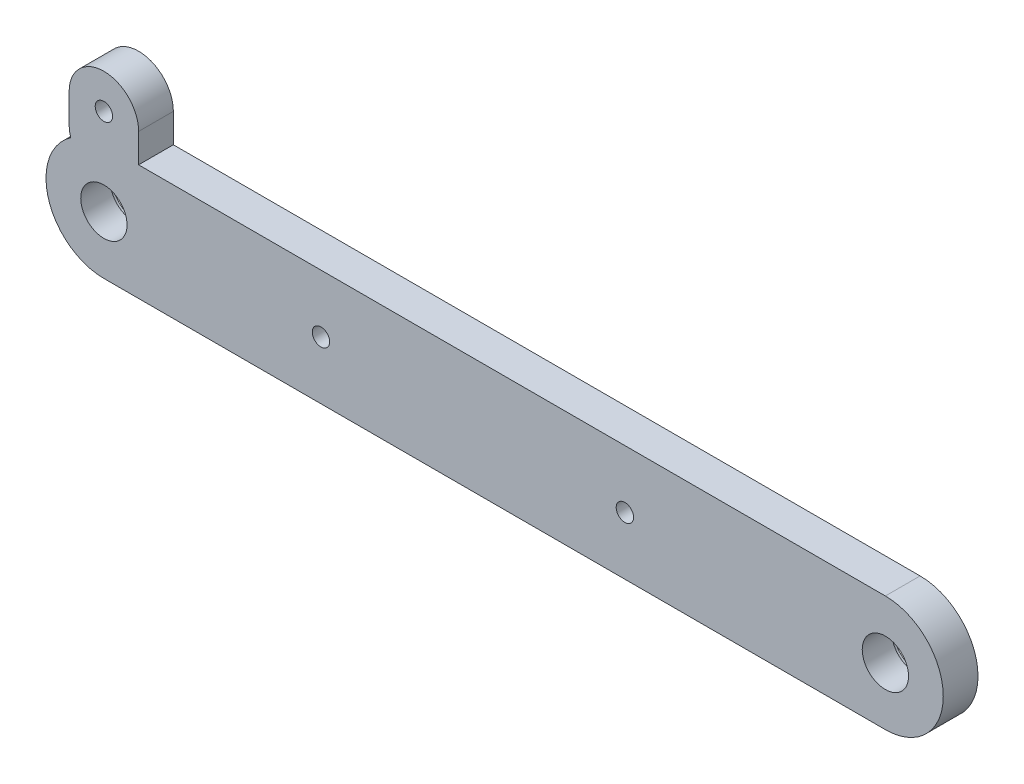
ISO-10303-21;
HEADER;
FILE_DESCRIPTION(('STEP AP214'),'2;1');
FILE_NAME('part.step','',(''),(''),'','','');
FILE_SCHEMA(('AUTOMOTIVE_DESIGN { 1 0 10303 214 1 1 1 1 }'));
ENDSEC;
DATA;
#1=APPLICATION_CONTEXT('core data for automotive mechanical design processes');
#2=APPLICATION_PROTOCOL_DEFINITION('international standard','automotive_design',2000,#1);
#3=PRODUCT_CONTEXT('',#1,'mechanical');
#4=PRODUCT('Part','Part','',(#3));
#5=PRODUCT_RELATED_PRODUCT_CATEGORY('part','',(#4));
#6=PRODUCT_DEFINITION_FORMATION('','',#4);
#7=PRODUCT_DEFINITION_CONTEXT('part definition',#1,'design');
#8=PRODUCT_DEFINITION('design','',#6,#7);
#9=PRODUCT_DEFINITION_SHAPE('','',#8);
#10=(LENGTH_UNIT() NAMED_UNIT(*) SI_UNIT(.MILLI.,.METRE.));
#11=(NAMED_UNIT(*) PLANE_ANGLE_UNIT() SI_UNIT($,.RADIAN.));
#12=(NAMED_UNIT(*) SI_UNIT($,.STERADIAN.) SOLID_ANGLE_UNIT());
#13=UNCERTAINTY_MEASURE_WITH_UNIT(LENGTH_MEASURE(1.E-05),#10,'distance_accuracy_value','');
#14=(GEOMETRIC_REPRESENTATION_CONTEXT(3) GLOBAL_UNCERTAINTY_ASSIGNED_CONTEXT((#13)) GLOBAL_UNIT_ASSIGNED_CONTEXT((#10,
#11,#12)) REPRESENTATION_CONTEXT('',''));
#15=CARTESIAN_POINT('',(0.,0.,0.));
#16=DIRECTION('',(0.,0.,1.));
#17=DIRECTION('',(1.,0.,0.));
#18=AXIS2_PLACEMENT_3D('',#15,#16,#17);
#19=CARTESIAN_POINT('',(0.,0.,6.));
#20=DIRECTION('',(0.,0.,-1.));
#21=DIRECTION('',(-1.,0.,0.));
#22=AXIS2_PLACEMENT_3D('',#19,#20,#21);
#23=CYLINDRICAL_SURFACE('',#22,4.);
#24=CARTESIAN_POINT('',(0.,0.,6.));
#25=DIRECTION('',(0.,0.,1.));
#26=DIRECTION('',(1.,0.,0.));
#27=AXIS2_PLACEMENT_3D('',#24,#25,#26);
#28=CIRCLE('',#27,4.);
#29=CARTESIAN_POINT('',(4.,0.,6.));
#30=VERTEX_POINT('',#29);
#31=EDGE_CURVE('E140',#30,#30,#28,.T.);
#32=ORIENTED_EDGE('',*,*,#31,.T.);
#33=EDGE_LOOP('',(#32));
#34=FACE_BOUND('',#33,.T.);
#35=CARTESIAN_POINT('',(0.,0.,0.9));
#36=DIRECTION('',(0.,0.,-1.));
#37=DIRECTION('',(-1.,0.,0.));
#38=AXIS2_PLACEMENT_3D('',#35,#36,#37);
#39=CIRCLE('',#38,4.);
#40=CARTESIAN_POINT('',(-4.,0.,0.9));
#41=VERTEX_POINT('',#40);
#42=EDGE_CURVE('E152',#41,#41,#39,.T.);
#43=ORIENTED_EDGE('',*,*,#42,.T.);
#44=EDGE_LOOP('',(#43));
#45=FACE_BOUND('',#44,.T.);
#46=ADVANCED_FACE('F43',(#34,#45),#23,.F.);
#47=CARTESIAN_POINT('',(0.,9.99999999999999,6.));
#48=DIRECTION('',(0.,0.,-1.));
#49=DIRECTION('',(-1.,0.,0.));
#50=AXIS2_PLACEMENT_3D('',#47,#48,#49);
#51=CYLINDRICAL_SURFACE('',#50,6.);
#52=CARTESIAN_POINT('',(0.,9.99999999999999,0.));
#53=DIRECTION('',(0.,0.,1.));
#54=DIRECTION('',(1.,0.,0.));
#55=AXIS2_PLACEMENT_3D('',#52,#53,#54);
#56=CIRCLE('',#55,6.);
#57=CARTESIAN_POINT('',(-6.,10.,0.));
#58=VERTEX_POINT('',#57);
#59=CARTESIAN_POINT('',(-5.72363520850168,8.2,0.));
#60=VERTEX_POINT('',#59);
#61=EDGE_CURVE('E149',#58,#60,#56,.T.);
#62=ORIENTED_EDGE('',*,*,#61,.T.);
#63=DIRECTION('',(0.,0.,-1.));
#64=VECTOR('',#63,1.);
#65=CARTESIAN_POINT('',(-5.72363520850168,8.2,6.));
#66=LINE('',#65,#64);
#67=CARTESIAN_POINT('',(-5.72363520850168,8.2,6.));
#68=VERTEX_POINT('',#67);
#69=EDGE_CURVE('E11',#68,#60,#66,.T.);
#70=ORIENTED_EDGE('',*,*,#69,.F.);
#71=CARTESIAN_POINT('',(0.,9.99999999999999,6.));
#72=DIRECTION('',(0.,0.,1.));
#73=DIRECTION('',(1.,0.,0.));
#74=AXIS2_PLACEMENT_3D('',#71,#72,#73);
#75=CIRCLE('',#74,6.);
#76=CARTESIAN_POINT('',(-6.,10.,6.));
#77=VERTEX_POINT('',#76);
#78=EDGE_CURVE('E168',#77,#68,#75,.T.);
#79=ORIENTED_EDGE('',*,*,#78,.F.);
#80=DIRECTION('',(0.,0.,-1.));
#81=VECTOR('',#80,1.);
#82=CARTESIAN_POINT('',(-6.,10.,6.));
#83=LINE('',#82,#81);
#84=EDGE_CURVE('E62',#77,#58,#83,.T.);
#85=ORIENTED_EDGE('',*,*,#84,.T.);
#86=EDGE_LOOP('',(#62,#70,#79,#85));
#87=FACE_BOUND('',#86,.T.);
#88=ADVANCED_FACE('F45',(#87),#51,.T.);
#89=CARTESIAN_POINT('',(0.,0.,6.));
#90=DIRECTION('',(0.,0.,-1.));
#91=DIRECTION('',(-1.,0.,0.));
#92=AXIS2_PLACEMENT_3D('',#89,#90,#91);
#93=CYLINDRICAL_SURFACE('',#92,10.);
#94=CARTESIAN_POINT('',(0.,0.,0.));
#95=DIRECTION('',(0.,0.,1.));
#96=DIRECTION('',(1.,0.,0.));
#97=AXIS2_PLACEMENT_3D('',#94,#95,#96);
#98=CIRCLE('',#97,10.);
#99=CARTESIAN_POINT('',(0.,-10.,0.));
#100=VERTEX_POINT('',#99);
#101=EDGE_CURVE('E151',#60,#100,#98,.T.);
#102=ORIENTED_EDGE('',*,*,#101,.T.);
#103=DIRECTION('',(0.,0.,-1.));
#104=VECTOR('',#103,1.);
#105=CARTESIAN_POINT('',(0.,-10.,6.));
#106=LINE('',#105,#104);
#107=CARTESIAN_POINT('',(0.,-10.,6.));
#108=VERTEX_POINT('',#107);
#109=EDGE_CURVE('E53',#108,#100,#106,.T.);
#110=ORIENTED_EDGE('',*,*,#109,.F.);
#111=CARTESIAN_POINT('',(0.,0.,6.));
#112=DIRECTION('',(0.,0.,1.));
#113=DIRECTION('',(1.,0.,0.));
#114=AXIS2_PLACEMENT_3D('',#111,#112,#113);
#115=CIRCLE('',#114,10.);
#116=EDGE_CURVE('E101',#68,#108,#115,.T.);
#117=ORIENTED_EDGE('',*,*,#116,.F.);
#118=ORIENTED_EDGE('',*,*,#69,.T.);
#119=EDGE_LOOP('',(#102,#110,#117,#118));
#120=FACE_BOUND('',#119,.T.);
#121=ADVANCED_FACE('F240',(#120),#93,.T.);
#122=CARTESIAN_POINT('',(0.,-10.,6.));
#123=DIRECTION('',(0.,1.,0.));
#124=DIRECTION('',(0.,0.,1.));
#125=AXIS2_PLACEMENT_3D('',#122,#123,#124);
#126=PLANE('',#125);
#127=DIRECTION('',(1.,0.,0.));
#128=VECTOR('',#127,1.);
#129=CARTESIAN_POINT('',(0.,-10.,0.));
#130=LINE('',#129,#128);
#131=CARTESIAN_POINT('',(135.,-10.,0.));
#132=VERTEX_POINT('',#131);
#133=EDGE_CURVE('E154',#100,#132,#130,.T.);
#134=ORIENTED_EDGE('',*,*,#133,.T.);
#135=DIRECTION('',(0.,0.,-1.));
#136=VECTOR('',#135,1.);
#137=CARTESIAN_POINT('',(135.,-10.,6.));
#138=LINE('',#137,#136);
#139=CARTESIAN_POINT('',(135.,-10.,6.));
#140=VERTEX_POINT('',#139);
#141=EDGE_CURVE('E174',#140,#132,#138,.T.);
#142=ORIENTED_EDGE('',*,*,#141,.F.);
#143=DIRECTION('',(1.,0.,0.));
#144=VECTOR('',#143,1.);
#145=CARTESIAN_POINT('',(0.,-10.,6.));
#146=LINE('',#145,#144);
#147=EDGE_CURVE('E213',#108,#140,#146,.T.);
#148=ORIENTED_EDGE('',*,*,#147,.F.);
#149=ORIENTED_EDGE('',*,*,#109,.T.);
#150=EDGE_LOOP('',(#134,#142,#148,#149));
#151=FACE_BOUND('',#150,.T.);
#152=ADVANCED_FACE('F430',(#151),#126,.F.);
#153=CARTESIAN_POINT('',(135.,0.,6.));
#154=DIRECTION('',(0.,0.,-1.));
#155=DIRECTION('',(-1.,0.,0.));
#156=AXIS2_PLACEMENT_3D('',#153,#154,#155);
#157=CYLINDRICAL_SURFACE('',#156,10.);
#158=CARTESIAN_POINT('',(135.,0.,0.));
#159=DIRECTION('',(0.,0.,1.));
#160=DIRECTION('',(1.,0.,0.));
#161=AXIS2_PLACEMENT_3D('',#158,#159,#160);
#162=CIRCLE('',#161,10.);
#163=CARTESIAN_POINT('',(135.,10.,0.));
#164=VERTEX_POINT('',#163);
#165=EDGE_CURVE('E156',#132,#164,#162,.T.);
#166=ORIENTED_EDGE('',*,*,#165,.T.);
#167=DIRECTION('',(0.,0.,-1.));
#168=VECTOR('',#167,1.);
#169=CARTESIAN_POINT('',(135.,10.,6.));
#170=LINE('',#169,#168);
#171=CARTESIAN_POINT('',(135.,10.,6.));
#172=VERTEX_POINT('',#171);
#173=EDGE_CURVE('E172',#172,#164,#170,.T.);
#174=ORIENTED_EDGE('',*,*,#173,.F.);
#175=CARTESIAN_POINT('',(135.,0.,6.));
#176=DIRECTION('',(0.,0.,1.));
#177=DIRECTION('',(1.,0.,0.));
#178=AXIS2_PLACEMENT_3D('',#175,#176,#177);
#179=CIRCLE('',#178,10.);
#180=EDGE_CURVE('E215',#140,#172,#179,.T.);
#181=ORIENTED_EDGE('',*,*,#180,.F.);
#182=ORIENTED_EDGE('',*,*,#141,.T.);
#183=EDGE_LOOP('',(#166,#174,#181,#182));
#184=FACE_BOUND('',#183,.T.);
#185=ADVANCED_FACE('F419',(#184),#157,.T.);
#186=CARTESIAN_POINT('',(0.,10.,6.));
#187=DIRECTION('',(0.,1.,0.));
#188=DIRECTION('',(0.,0.,1.));
#189=AXIS2_PLACEMENT_3D('',#186,#187,#188);
#190=PLANE('',#189);
#191=DIRECTION('',(1.,0.,0.));
#192=VECTOR('',#191,1.);
#193=CARTESIAN_POINT('',(0.,10.,0.));
#194=LINE('',#193,#192);
#195=CARTESIAN_POINT('',(6.,10.,0.));
#196=VERTEX_POINT('',#195);
#197=EDGE_CURVE('E159',#196,#164,#194,.T.);
#198=ORIENTED_EDGE('',*,*,#197,.F.);
#199=DIRECTION('',(0.,0.,-1.));
#200=VECTOR('',#199,1.);
#201=CARTESIAN_POINT('',(6.,10.,6.));
#202=LINE('',#201,#200);
#203=CARTESIAN_POINT('',(6.,10.,6.));
#204=VERTEX_POINT('',#203);
#205=EDGE_CURVE('E135',#204,#196,#202,.T.);
#206=ORIENTED_EDGE('',*,*,#205,.F.);
#207=DIRECTION('',(1.,0.,0.));
#208=VECTOR('',#207,1.);
#209=CARTESIAN_POINT('',(0.,10.,6.));
#210=LINE('',#209,#208);
#211=EDGE_CURVE('E125',#204,#172,#210,.T.);
#212=ORIENTED_EDGE('',*,*,#211,.T.);
#213=ORIENTED_EDGE('',*,*,#173,.T.);
#214=EDGE_LOOP('',(#198,#206,#212,#213));
#215=FACE_BOUND('',#214,.T.);
#216=ADVANCED_FACE('F218',(#215),#190,.T.);
#217=CARTESIAN_POINT('',(6.,0.,6.));
#218=DIRECTION('',(-1.,0.,0.));
#219=DIRECTION('',(0.,-1.,0.));
#220=AXIS2_PLACEMENT_3D('',#217,#218,#219);
#221=PLANE('',#220);
#222=DIRECTION('',(0.,1.,0.));
#223=VECTOR('',#222,1.);
#224=CARTESIAN_POINT('',(6.,0.,0.));
#225=LINE('',#224,#223);
#226=CARTESIAN_POINT('',(6.,15.,0.));
#227=VERTEX_POINT('',#226);
#228=EDGE_CURVE('E132',#196,#227,#225,.T.);
#229=ORIENTED_EDGE('',*,*,#228,.T.);
#230=DIRECTION('',(0.,0.,-1.));
#231=VECTOR('',#230,1.);
#232=CARTESIAN_POINT('',(6.,15.,6.));
#233=LINE('',#232,#231);
#234=CARTESIAN_POINT('',(6.,15.,6.));
#235=VERTEX_POINT('',#234);
#236=EDGE_CURVE('E129',#235,#227,#233,.T.);
#237=ORIENTED_EDGE('',*,*,#236,.F.);
#238=DIRECTION('',(0.,1.,0.));
#239=VECTOR('',#238,1.);
#240=CARTESIAN_POINT('',(6.,0.,6.));
#241=LINE('',#240,#239);
#242=EDGE_CURVE('E117',#204,#235,#241,.T.);
#243=ORIENTED_EDGE('',*,*,#242,.F.);
#244=ORIENTED_EDGE('',*,*,#205,.T.);
#245=EDGE_LOOP('',(#229,#237,#243,#244));
#246=FACE_BOUND('',#245,.T.);
#247=ADVANCED_FACE('F130',(#246),#221,.F.);
#248=CARTESIAN_POINT('',(0.,15.,6.));
#249=DIRECTION('',(0.,0.,-1.));
#250=DIRECTION('',(-1.,0.,0.));
#251=AXIS2_PLACEMENT_3D('',#248,#249,#250);
#252=CYLINDRICAL_SURFACE('',#251,6.);
#253=CARTESIAN_POINT('',(0.,15.,0.));
#254=DIRECTION('',(0.,0.,1.));
#255=DIRECTION('',(1.,0.,0.));
#256=AXIS2_PLACEMENT_3D('',#253,#254,#255);
#257=CIRCLE('',#256,6.);
#258=CARTESIAN_POINT('',(-6.,15.,0.));
#259=VERTEX_POINT('',#258);
#260=EDGE_CURVE('E163',#227,#259,#257,.T.);
#261=ORIENTED_EDGE('',*,*,#260,.T.);
#262=DIRECTION('',(0.,0.,-1.));
#263=VECTOR('',#262,1.);
#264=CARTESIAN_POINT('',(-6.,15.,6.));
#265=LINE('',#264,#263);
#266=CARTESIAN_POINT('',(-6.,15.,6.));
#267=VERTEX_POINT('',#266);
#268=EDGE_CURVE('E89',#267,#259,#265,.T.);
#269=ORIENTED_EDGE('',*,*,#268,.F.);
#270=CARTESIAN_POINT('',(0.,15.,6.));
#271=DIRECTION('',(0.,0.,1.));
#272=DIRECTION('',(1.,0.,0.));
#273=AXIS2_PLACEMENT_3D('',#270,#271,#272);
#274=CIRCLE('',#273,6.);
#275=EDGE_CURVE('E123',#235,#267,#274,.T.);
#276=ORIENTED_EDGE('',*,*,#275,.F.);
#277=ORIENTED_EDGE('',*,*,#236,.T.);
#278=EDGE_LOOP('',(#261,#269,#276,#277));
#279=FACE_BOUND('',#278,.T.);
#280=ADVANCED_FACE('F137',(#279),#252,.T.);
#281=CARTESIAN_POINT('',(-6.,0.,6.));
#282=DIRECTION('',(-1.,0.,0.));
#283=DIRECTION('',(0.,-1.,0.));
#284=AXIS2_PLACEMENT_3D('',#281,#282,#283);
#285=PLANE('',#284);
#286=DIRECTION('',(0.,1.,0.));
#287=VECTOR('',#286,1.);
#288=CARTESIAN_POINT('',(-6.,0.,0.));
#289=LINE('',#288,#287);
#290=EDGE_CURVE('E165',#58,#259,#289,.T.);
#291=ORIENTED_EDGE('',*,*,#290,.F.);
#292=ORIENTED_EDGE('',*,*,#84,.F.);
#293=DIRECTION('',(0.,1.,0.));
#294=VECTOR('',#293,1.);
#295=CARTESIAN_POINT('',(-6.,0.,6.));
#296=LINE('',#295,#294);
#297=EDGE_CURVE('E138',#77,#267,#296,.T.);
#298=ORIENTED_EDGE('',*,*,#297,.T.);
#299=ORIENTED_EDGE('',*,*,#268,.T.);
#300=EDGE_LOOP('',(#291,#292,#298,#299));
#301=FACE_BOUND('',#300,.T.);
#302=ADVANCED_FACE('F223',(#301),#285,.T.);
#303=CARTESIAN_POINT('',(135.,0.,6.));
#304=DIRECTION('',(0.,0.,-1.));
#305=DIRECTION('',(-1.,0.,0.));
#306=AXIS2_PLACEMENT_3D('',#303,#304,#305);
#307=CYLINDRICAL_SURFACE('',#306,3.99999999999999);
#308=CARTESIAN_POINT('',(135.,0.,0.9));
#309=DIRECTION('',(0.,0.,-1.));
#310=DIRECTION('',(-1.,0.,0.));
#311=AXIS2_PLACEMENT_3D('',#308,#309,#310);
#312=CIRCLE('',#311,4.);
#313=CARTESIAN_POINT('',(131.,0.,0.9));
#314=VERTEX_POINT('',#313);
#315=EDGE_CURVE('E196',#314,#314,#312,.T.);
#316=ORIENTED_EDGE('',*,*,#315,.T.);
#317=EDGE_LOOP('',(#316));
#318=FACE_BOUND('',#317,.T.);
#319=CARTESIAN_POINT('',(135.,0.,6.));
#320=DIRECTION('',(0.,0.,1.));
#321=DIRECTION('',(1.,0.,0.));
#322=AXIS2_PLACEMENT_3D('',#319,#320,#321);
#323=CIRCLE('',#322,3.99999999999999);
#324=CARTESIAN_POINT('',(139.,0.,6.));
#325=VERTEX_POINT('',#324);
#326=EDGE_CURVE('E146',#325,#325,#323,.T.);
#327=ORIENTED_EDGE('',*,*,#326,.T.);
#328=EDGE_LOOP('',(#327));
#329=FACE_BOUND('',#328,.T.);
#330=ADVANCED_FACE('F225',(#318,#329),#307,.F.);
#331=CARTESIAN_POINT('',(0.,0.,6.));
#332=DIRECTION('',(0.,0.,1.));
#333=DIRECTION('',(1.,0.,0.));
#334=AXIS2_PLACEMENT_3D('',#331,#332,#333);
#335=PLANE('',#334);
#336=CARTESIAN_POINT('',(0.,15.,6.));
#337=DIRECTION('',(0.,0.,-1.));
#338=DIRECTION('',(-1.,0.,0.));
#339=AXIS2_PLACEMENT_3D('',#336,#337,#338);
#340=CIRCLE('',#339,1.5);
#341=CARTESIAN_POINT('',(-1.5,15.,6.));
#342=VERTEX_POINT('',#341);
#343=EDGE_CURVE('E282',#342,#342,#340,.T.);
#344=ORIENTED_EDGE('',*,*,#343,.T.);
#345=EDGE_LOOP('',(#344));
#346=FACE_BOUND('',#345,.T.);
#347=CARTESIAN_POINT('',(90.,0.,6.));
#348=DIRECTION('',(0.,0.,-1.));
#349=DIRECTION('',(-1.,0.,0.));
#350=AXIS2_PLACEMENT_3D('',#347,#348,#349);
#351=CIRCLE('',#350,1.5);
#352=CARTESIAN_POINT('',(88.5,0.,6.));
#353=VERTEX_POINT('',#352);
#354=EDGE_CURVE('E280',#353,#353,#351,.T.);
#355=ORIENTED_EDGE('',*,*,#354,.T.);
#356=EDGE_LOOP('',(#355));
#357=FACE_BOUND('',#356,.T.);
#358=CARTESIAN_POINT('',(37.5,0.,6.));
#359=DIRECTION('',(0.,0.,-1.));
#360=DIRECTION('',(-1.,0.,0.));
#361=AXIS2_PLACEMENT_3D('',#358,#359,#360);
#362=CIRCLE('',#361,1.5);
#363=CARTESIAN_POINT('',(36.,0.,6.));
#364=VERTEX_POINT('',#363);
#365=EDGE_CURVE('E182',#364,#364,#362,.T.);
#366=ORIENTED_EDGE('',*,*,#365,.T.);
#367=EDGE_LOOP('',(#366));
#368=FACE_BOUND('',#367,.T.);
#369=ORIENTED_EDGE('',*,*,#78,.T.);
#370=ORIENTED_EDGE('',*,*,#116,.T.);
#371=ORIENTED_EDGE('',*,*,#147,.T.);
#372=ORIENTED_EDGE('',*,*,#180,.T.);
#373=ORIENTED_EDGE('',*,*,#211,.F.);
#374=ORIENTED_EDGE('',*,*,#242,.T.);
#375=ORIENTED_EDGE('',*,*,#275,.T.);
#376=ORIENTED_EDGE('',*,*,#297,.F.);
#377=EDGE_LOOP('',(#369,#370,#371,#372,#373,#374,#375,#376));
#378=FACE_BOUND('',#377,.T.);
#379=ORIENTED_EDGE('',*,*,#31,.F.);
#380=EDGE_LOOP('',(#379));
#381=FACE_BOUND('',#380,.T.);
#382=ORIENTED_EDGE('',*,*,#326,.F.);
#383=EDGE_LOOP('',(#382));
#384=FACE_BOUND('',#383,.T.);
#385=ADVANCED_FACE('F119',(#346,#357,#368,#378,#381,#384),#335,.T.);
#386=CARTESIAN_POINT('',(0.,0.,0.));
#387=DIRECTION('',(0.,0.,1.));
#388=DIRECTION('',(1.,0.,0.));
#389=AXIS2_PLACEMENT_3D('',#386,#387,#388);
#390=PLANE('',#389);
#391=CARTESIAN_POINT('',(0.,15.,0.));
#392=DIRECTION('',(0.,0.,1.));
#393=DIRECTION('',(1.,0.,0.));
#394=AXIS2_PLACEMENT_3D('',#391,#392,#393);
#395=CIRCLE('',#394,1.5);
#396=CARTESIAN_POINT('',(1.5,15.,0.));
#397=VERTEX_POINT('',#396);
#398=EDGE_CURVE('E47',#397,#397,#395,.T.);
#399=ORIENTED_EDGE('',*,*,#398,.T.);
#400=EDGE_LOOP('',(#399));
#401=FACE_BOUND('',#400,.T.);
#402=CARTESIAN_POINT('',(90.,0.,0.));
#403=DIRECTION('',(0.,0.,1.));
#404=DIRECTION('',(1.,0.,0.));
#405=AXIS2_PLACEMENT_3D('',#402,#403,#404);
#406=CIRCLE('',#405,1.5);
#407=CARTESIAN_POINT('',(91.5,0.,0.));
#408=VERTEX_POINT('',#407);
#409=EDGE_CURVE('E181',#408,#408,#406,.T.);
#410=ORIENTED_EDGE('',*,*,#409,.T.);
#411=EDGE_LOOP('',(#410));
#412=FACE_BOUND('',#411,.T.);
#413=CARTESIAN_POINT('',(37.5,0.,0.));
#414=DIRECTION('',(0.,0.,1.));
#415=DIRECTION('',(1.,0.,0.));
#416=AXIS2_PLACEMENT_3D('',#413,#414,#415);
#417=CIRCLE('',#416,1.5);
#418=CARTESIAN_POINT('',(39.,0.,0.));
#419=VERTEX_POINT('',#418);
#420=EDGE_CURVE('E179',#419,#419,#417,.T.);
#421=ORIENTED_EDGE('',*,*,#420,.T.);
#422=EDGE_LOOP('',(#421));
#423=FACE_BOUND('',#422,.T.);
#424=CARTESIAN_POINT('',(135.,0.,0.));
#425=DIRECTION('',(0.,0.,-1.));
#426=DIRECTION('',(-1.,0.,0.));
#427=AXIS2_PLACEMENT_3D('',#424,#425,#426);
#428=CIRCLE('',#427,4.75);
#429=CARTESIAN_POINT('',(130.25,0.,0.));
#430=VERTEX_POINT('',#429);
#431=EDGE_CURVE('E187',#430,#430,#428,.T.);
#432=ORIENTED_EDGE('',*,*,#431,.F.);
#433=EDGE_LOOP('',(#432));
#434=FACE_BOUND('',#433,.T.);
#435=CARTESIAN_POINT('',(0.,0.,0.));
#436=DIRECTION('',(0.,0.,-1.));
#437=DIRECTION('',(-1.,0.,0.));
#438=AXIS2_PLACEMENT_3D('',#435,#436,#437);
#439=CIRCLE('',#438,4.75);
#440=CARTESIAN_POINT('',(-4.75,0.,0.));
#441=VERTEX_POINT('',#440);
#442=EDGE_CURVE('E203',#441,#441,#439,.T.);
#443=ORIENTED_EDGE('',*,*,#442,.F.);
#444=EDGE_LOOP('',(#443));
#445=FACE_BOUND('',#444,.T.);
#446=ORIENTED_EDGE('',*,*,#61,.F.);
#447=ORIENTED_EDGE('',*,*,#290,.T.);
#448=ORIENTED_EDGE('',*,*,#260,.F.);
#449=ORIENTED_EDGE('',*,*,#228,.F.);
#450=ORIENTED_EDGE('',*,*,#197,.T.);
#451=ORIENTED_EDGE('',*,*,#165,.F.);
#452=ORIENTED_EDGE('',*,*,#133,.F.);
#453=ORIENTED_EDGE('',*,*,#101,.F.);
#454=EDGE_LOOP('',(#446,#447,#448,#449,#450,#451,#452,#453));
#455=FACE_BOUND('',#454,.T.);
#456=ADVANCED_FACE('F221',(#401,#412,#423,#434,#445,#455),#390,.F.);
#457=CARTESIAN_POINT('',(4.,0.,0.9));
#458=DIRECTION('',(0.,0.,1.));
#459=DIRECTION('',(1.,0.,0.));
#460=AXIS2_PLACEMENT_3D('',#457,#458,#459);
#461=PLANE('',#460);
#462=ORIENTED_EDGE('',*,*,#42,.F.);
#463=EDGE_LOOP('',(#462));
#464=FACE_BOUND('',#463,.T.);
#465=CARTESIAN_POINT('',(0.,0.,0.9));
#466=DIRECTION('',(0.,0.,-1.));
#467=DIRECTION('',(-1.,0.,0.));
#468=AXIS2_PLACEMENT_3D('',#465,#466,#467);
#469=CIRCLE('',#468,4.75);
#470=CARTESIAN_POINT('',(-4.75,0.,0.9));
#471=VERTEX_POINT('',#470);
#472=EDGE_CURVE('E206',#471,#471,#469,.T.);
#473=ORIENTED_EDGE('',*,*,#472,.T.);
#474=EDGE_LOOP('',(#473));
#475=FACE_BOUND('',#474,.T.);
#476=ADVANCED_FACE('F245',(#464,#475),#461,.F.);
#477=CARTESIAN_POINT('',(0.,0.,0.));
#478=DIRECTION('',(0.,0.,-1.));
#479=DIRECTION('',(-1.,0.,0.));
#480=AXIS2_PLACEMENT_3D('',#477,#478,#479);
#481=CYLINDRICAL_SURFACE('',#480,4.75);
#482=ORIENTED_EDGE('',*,*,#472,.F.);
#483=EDGE_LOOP('',(#482));
#484=FACE_BOUND('',#483,.T.);
#485=ORIENTED_EDGE('',*,*,#442,.T.);
#486=EDGE_LOOP('',(#485));
#487=FACE_BOUND('',#486,.T.);
#488=ADVANCED_FACE('F251',(#484,#487),#481,.F.);
#489=CARTESIAN_POINT('',(139.,0.,0.9));
#490=DIRECTION('',(0.,0.,1.));
#491=DIRECTION('',(1.,0.,0.));
#492=AXIS2_PLACEMENT_3D('',#489,#490,#491);
#493=PLANE('',#492);
#494=ORIENTED_EDGE('',*,*,#315,.F.);
#495=EDGE_LOOP('',(#494));
#496=FACE_BOUND('',#495,.T.);
#497=CARTESIAN_POINT('',(135.,0.,0.9));
#498=DIRECTION('',(0.,0.,-1.));
#499=DIRECTION('',(-1.,0.,0.));
#500=AXIS2_PLACEMENT_3D('',#497,#498,#499);
#501=CIRCLE('',#500,4.75);
#502=CARTESIAN_POINT('',(130.25,0.,0.9));
#503=VERTEX_POINT('',#502);
#504=EDGE_CURVE('E191',#503,#503,#501,.T.);
#505=ORIENTED_EDGE('',*,*,#504,.T.);
#506=EDGE_LOOP('',(#505));
#507=FACE_BOUND('',#506,.T.);
#508=ADVANCED_FACE('F255',(#496,#507),#493,.F.);
#509=CARTESIAN_POINT('',(135.,0.,0.));
#510=DIRECTION('',(0.,0.,-1.));
#511=DIRECTION('',(-1.,0.,0.));
#512=AXIS2_PLACEMENT_3D('',#509,#510,#511);
#513=CYLINDRICAL_SURFACE('',#512,4.75);
#514=ORIENTED_EDGE('',*,*,#504,.F.);
#515=EDGE_LOOP('',(#514));
#516=FACE_BOUND('',#515,.T.);
#517=ORIENTED_EDGE('',*,*,#431,.T.);
#518=EDGE_LOOP('',(#517));
#519=FACE_BOUND('',#518,.T.);
#520=ADVANCED_FACE('F259',(#516,#519),#513,.F.);
#521=CARTESIAN_POINT('',(37.5,0.,6.));
#522=DIRECTION('',(0.,0.,-1.));
#523=DIRECTION('',(-1.,0.,0.));
#524=AXIS2_PLACEMENT_3D('',#521,#522,#523);
#525=CYLINDRICAL_SURFACE('',#524,1.5);
#526=ORIENTED_EDGE('',*,*,#365,.F.);
#527=EDGE_LOOP('',(#526));
#528=FACE_BOUND('',#527,.T.);
#529=ORIENTED_EDGE('',*,*,#420,.F.);
#530=EDGE_LOOP('',(#529));
#531=FACE_BOUND('',#530,.T.);
#532=ADVANCED_FACE('F263',(#528,#531),#525,.F.);
#533=CARTESIAN_POINT('',(90.,0.,6.));
#534=DIRECTION('',(0.,0.,-1.));
#535=DIRECTION('',(-1.,0.,0.));
#536=AXIS2_PLACEMENT_3D('',#533,#534,#535);
#537=CYLINDRICAL_SURFACE('',#536,1.5);
#538=ORIENTED_EDGE('',*,*,#354,.F.);
#539=EDGE_LOOP('',(#538));
#540=FACE_BOUND('',#539,.T.);
#541=ORIENTED_EDGE('',*,*,#409,.F.);
#542=EDGE_LOOP('',(#541));
#543=FACE_BOUND('',#542,.T.);
#544=ADVANCED_FACE('F267',(#540,#543),#537,.F.);
#545=CARTESIAN_POINT('',(0.,15.,6.));
#546=DIRECTION('',(0.,0.,-1.));
#547=DIRECTION('',(-1.,0.,0.));
#548=AXIS2_PLACEMENT_3D('',#545,#546,#547);
#549=CYLINDRICAL_SURFACE('',#548,1.5);
#550=ORIENTED_EDGE('',*,*,#343,.F.);
#551=EDGE_LOOP('',(#550));
#552=FACE_BOUND('',#551,.T.);
#553=ORIENTED_EDGE('',*,*,#398,.F.);
#554=EDGE_LOOP('',(#553));
#555=FACE_BOUND('',#554,.T.);
#556=ADVANCED_FACE('F269',(#552,#555),#549,.F.);
#557=CLOSED_SHELL('',(#46,#88,#121,#152,#185,#216,#247,#280,#302,#330,#385,#456,#476,#488,#508,
#520,#532,#544,#556));
#558=MANIFOLD_SOLID_BREP('B2',#557);
#559=ADVANCED_BREP_SHAPE_REPRESENTATION('',(#18,#558),#14);
#560=SHAPE_DEFINITION_REPRESENTATION(#9,#559);
ENDSEC;
END-ISO-10303-21;
